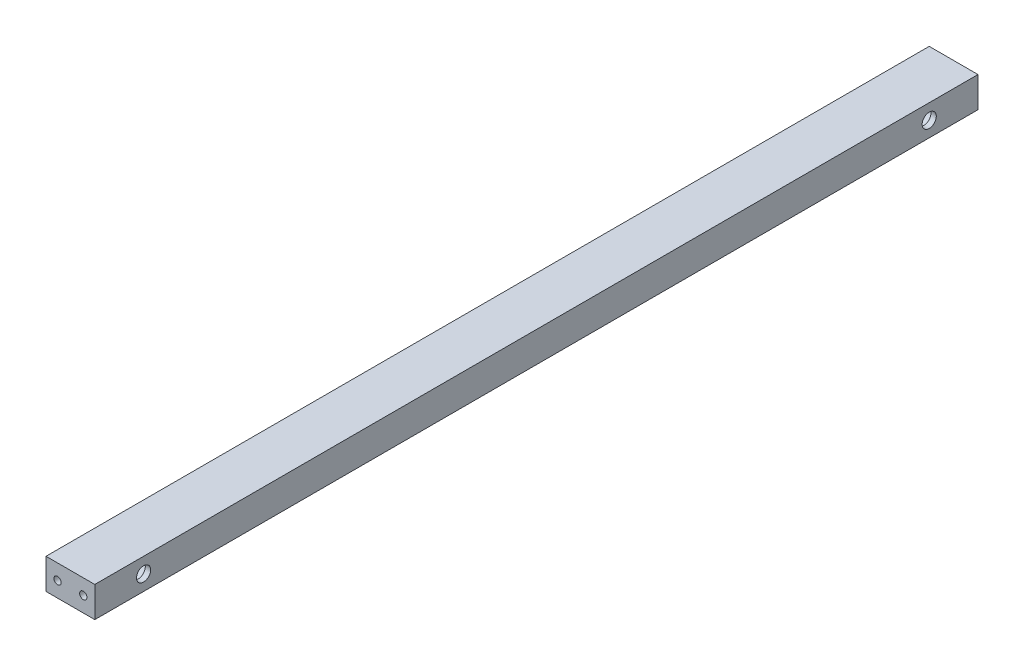
ISO-10303-21;
HEADER;
FILE_DESCRIPTION(('STEP AP214'),'2;1');
FILE_NAME('part.step','',(''),(''),'','','');
FILE_SCHEMA(('AUTOMOTIVE_DESIGN { 1 0 10303 214 1 1 1 1 }'));
ENDSEC;
DATA;
#1=APPLICATION_CONTEXT('core data for automotive mechanical design processes');
#2=APPLICATION_PROTOCOL_DEFINITION('international standard','automotive_design',2000,#1);
#3=PRODUCT_CONTEXT('',#1,'mechanical');
#4=PRODUCT('Part','Part','',(#3));
#5=PRODUCT_RELATED_PRODUCT_CATEGORY('part','',(#4));
#6=PRODUCT_DEFINITION_FORMATION('','',#4);
#7=PRODUCT_DEFINITION_CONTEXT('part definition',#1,'design');
#8=PRODUCT_DEFINITION('design','',#6,#7);
#9=PRODUCT_DEFINITION_SHAPE('','',#8);
#10=(LENGTH_UNIT() NAMED_UNIT(*) SI_UNIT(.MILLI.,.METRE.));
#11=(NAMED_UNIT(*) PLANE_ANGLE_UNIT() SI_UNIT($,.RADIAN.));
#12=(NAMED_UNIT(*) SI_UNIT($,.STERADIAN.) SOLID_ANGLE_UNIT());
#13=UNCERTAINTY_MEASURE_WITH_UNIT(LENGTH_MEASURE(1.E-05),#10,'distance_accuracy_value','');
#14=(GEOMETRIC_REPRESENTATION_CONTEXT(3) GLOBAL_UNCERTAINTY_ASSIGNED_CONTEXT((#13)) GLOBAL_UNIT_ASSIGNED_CONTEXT((#10,
#11,#12)) REPRESENTATION_CONTEXT('',''));
#15=CARTESIAN_POINT('',(0.,0.,0.));
#16=DIRECTION('',(0.,0.,1.));
#17=DIRECTION('',(1.,0.,0.));
#18=AXIS2_PLACEMENT_3D('',#15,#16,#17);
#19=CARTESIAN_POINT('',(0.,0.,459.74));
#20=DIRECTION('',(1.,0.,0.));
#21=DIRECTION('',(0.,1.,0.));
#22=AXIS2_PLACEMENT_3D('',#19,#20,#21);
#23=PLANE('',#22);
#24=CARTESIAN_POINT('',(0.,7.93749999999995,25.4));
#25=DIRECTION('',(-1.,0.,0.));
#26=DIRECTION('',(0.,1.,0.));
#27=AXIS2_PLACEMENT_3D('',#24,#25,#26);
#28=CIRCLE('',#27,6.81989999999997);
#29=CARTESIAN_POINT('',(0.,14.7573999999999,25.4));
#30=VERTEX_POINT('',#29);
#31=EDGE_CURVE('E188',#30,#30,#28,.T.);
#32=ORIENTED_EDGE('',*,*,#31,.F.);
#33=EDGE_LOOP('',(#32));
#34=FACE_BOUND('',#33,.T.);
#35=CARTESIAN_POINT('',(0.,7.9375,434.34));
#36=DIRECTION('',(-1.,0.,0.));
#37=DIRECTION('',(0.,-1.,0.));
#38=AXIS2_PLACEMENT_3D('',#35,#36,#37);
#39=CIRCLE('',#38,6.81989999999997);
#40=CARTESIAN_POINT('',(0.,1.11760000000003,434.34));
#41=VERTEX_POINT('',#40);
#42=EDGE_CURVE('E192',#41,#41,#39,.T.);
#43=ORIENTED_EDGE('',*,*,#42,.F.);
#44=EDGE_LOOP('',(#43));
#45=FACE_BOUND('',#44,.T.);
#46=DIRECTION('',(0.,-1.,0.));
#47=VECTOR('',#46,1.);
#48=CARTESIAN_POINT('',(0.,0.,0.));
#49=LINE('',#48,#47);
#50=CARTESIAN_POINT('',(0.,15.875,0.));
#51=VERTEX_POINT('',#50);
#52=CARTESIAN_POINT('',(0.,0.,0.));
#53=VERTEX_POINT('',#52);
#54=EDGE_CURVE('E107',#51,#53,#49,.T.);
#55=ORIENTED_EDGE('',*,*,#54,.T.);
#56=DIRECTION('',(0.,0.,-1.));
#57=VECTOR('',#56,1.);
#58=CARTESIAN_POINT('',(0.,0.,459.74));
#59=LINE('',#58,#57);
#60=CARTESIAN_POINT('',(0.,0.,459.74));
#61=VERTEX_POINT('',#60);
#62=EDGE_CURVE('E11',#61,#53,#59,.T.);
#63=ORIENTED_EDGE('',*,*,#62,.F.);
#64=DIRECTION('',(0.,-1.,0.));
#65=VECTOR('',#64,1.);
#66=CARTESIAN_POINT('',(0.,0.,459.74));
#67=LINE('',#66,#65);
#68=CARTESIAN_POINT('',(0.,15.875,459.74));
#69=VERTEX_POINT('',#68);
#70=EDGE_CURVE('E94',#69,#61,#67,.T.);
#71=ORIENTED_EDGE('',*,*,#70,.F.);
#72=DIRECTION('',(0.,0.,-1.));
#73=VECTOR('',#72,1.);
#74=CARTESIAN_POINT('',(0.,15.875,459.74));
#75=LINE('',#74,#73);
#76=EDGE_CURVE('E103',#69,#51,#75,.T.);
#77=ORIENTED_EDGE('',*,*,#76,.T.);
#78=EDGE_LOOP('',(#55,#63,#71,#77));
#79=FACE_BOUND('',#78,.T.);
#80=ADVANCED_FACE('F37',(#34,#45,#79),#23,.F.);
#81=CARTESIAN_POINT('',(0.,0.,459.74));
#82=DIRECTION('',(0.,1.,0.));
#83=DIRECTION('',(0.,0.,1.));
#84=AXIS2_PLACEMENT_3D('',#81,#82,#83);
#85=PLANE('',#84);
#86=DIRECTION('',(1.,0.,0.));
#87=VECTOR('',#86,1.);
#88=CARTESIAN_POINT('',(0.,0.,0.));
#89=LINE('',#88,#87);
#90=CARTESIAN_POINT('',(25.4,0.,0.));
#91=VERTEX_POINT('',#90);
#92=EDGE_CURVE('E98',#53,#91,#89,.T.);
#93=ORIENTED_EDGE('',*,*,#92,.T.);
#94=DIRECTION('',(0.,0.,-1.));
#95=VECTOR('',#94,1.);
#96=CARTESIAN_POINT('',(25.4,0.,459.74));
#97=LINE('',#96,#95);
#98=CARTESIAN_POINT('',(25.4,0.,459.74));
#99=VERTEX_POINT('',#98);
#100=EDGE_CURVE('E50',#99,#91,#97,.T.);
#101=ORIENTED_EDGE('',*,*,#100,.F.);
#102=DIRECTION('',(1.,0.,0.));
#103=VECTOR('',#102,1.);
#104=CARTESIAN_POINT('',(0.,0.,459.74));
#105=LINE('',#104,#103);
#106=EDGE_CURVE('E89',#61,#99,#105,.T.);
#107=ORIENTED_EDGE('',*,*,#106,.F.);
#108=ORIENTED_EDGE('',*,*,#62,.T.);
#109=EDGE_LOOP('',(#93,#101,#107,#108));
#110=FACE_BOUND('',#109,.T.);
#111=ADVANCED_FACE('F97',(#110),#85,.F.);
#112=CARTESIAN_POINT('',(25.4,0.,459.74));
#113=DIRECTION('',(-1.,0.,0.));
#114=DIRECTION('',(0.,-1.,0.));
#115=AXIS2_PLACEMENT_3D('',#112,#113,#114);
#116=PLANE('',#115);
#117=CARTESIAN_POINT('',(25.4,7.93749999999995,25.4));
#118=DIRECTION('',(-1.,0.,0.));
#119=DIRECTION('',(0.,-1.,0.));
#120=AXIS2_PLACEMENT_3D('',#117,#118,#119);
#121=CIRCLE('',#120,3.68299999999999);
#122=CARTESIAN_POINT('',(25.4,4.25449999999996,25.4));
#123=VERTEX_POINT('',#122);
#124=EDGE_CURVE('E116',#123,#123,#121,.T.);
#125=ORIENTED_EDGE('',*,*,#124,.T.);
#126=EDGE_LOOP('',(#125));
#127=FACE_BOUND('',#126,.T.);
#128=CARTESIAN_POINT('',(25.4,7.9375,434.34));
#129=DIRECTION('',(-1.,0.,0.));
#130=DIRECTION('',(0.,-1.,0.));
#131=AXIS2_PLACEMENT_3D('',#128,#129,#130);
#132=CIRCLE('',#131,3.68299999999999);
#133=CARTESIAN_POINT('',(25.4,4.25450000000001,434.34));
#134=VERTEX_POINT('',#133);
#135=EDGE_CURVE('E219',#134,#134,#132,.T.);
#136=ORIENTED_EDGE('',*,*,#135,.T.);
#137=EDGE_LOOP('',(#136));
#138=FACE_BOUND('',#137,.T.);
#139=DIRECTION('',(0.,1.,0.));
#140=VECTOR('',#139,1.);
#141=CARTESIAN_POINT('',(25.4,0.,0.));
#142=LINE('',#141,#140);
#143=CARTESIAN_POINT('',(25.4,15.875,0.));
#144=VERTEX_POINT('',#143);
#145=EDGE_CURVE('E76',#91,#144,#142,.T.);
#146=ORIENTED_EDGE('',*,*,#145,.T.);
#147=DIRECTION('',(0.,0.,-1.));
#148=VECTOR('',#147,1.);
#149=CARTESIAN_POINT('',(25.4,15.875,459.74));
#150=LINE('',#149,#148);
#151=CARTESIAN_POINT('',(25.4,15.875,459.74));
#152=VERTEX_POINT('',#151);
#153=EDGE_CURVE('E99',#152,#144,#150,.T.);
#154=ORIENTED_EDGE('',*,*,#153,.F.);
#155=DIRECTION('',(0.,1.,0.));
#156=VECTOR('',#155,1.);
#157=CARTESIAN_POINT('',(25.4,0.,459.74));
#158=LINE('',#157,#156);
#159=EDGE_CURVE('E92',#99,#152,#158,.T.);
#160=ORIENTED_EDGE('',*,*,#159,.F.);
#161=ORIENTED_EDGE('',*,*,#100,.T.);
#162=EDGE_LOOP('',(#146,#154,#160,#161));
#163=FACE_BOUND('',#162,.T.);
#164=ADVANCED_FACE('F101',(#127,#138,#163),#116,.F.);
#165=CARTESIAN_POINT('',(0.,15.875,459.74));
#166=DIRECTION('',(0.,-1.,0.));
#167=DIRECTION('',(0.,0.,-1.));
#168=AXIS2_PLACEMENT_3D('',#165,#166,#167);
#169=PLANE('',#168);
#170=DIRECTION('',(-1.,0.,0.));
#171=VECTOR('',#170,1.);
#172=CARTESIAN_POINT('',(0.,15.875,0.));
#173=LINE('',#172,#171);
#174=EDGE_CURVE('E82',#144,#51,#173,.T.);
#175=ORIENTED_EDGE('',*,*,#174,.T.);
#176=ORIENTED_EDGE('',*,*,#76,.F.);
#177=DIRECTION('',(-1.,0.,0.));
#178=VECTOR('',#177,1.);
#179=CARTESIAN_POINT('',(0.,15.875,459.74));
#180=LINE('',#179,#178);
#181=EDGE_CURVE('E59',#152,#69,#180,.T.);
#182=ORIENTED_EDGE('',*,*,#181,.F.);
#183=ORIENTED_EDGE('',*,*,#153,.T.);
#184=EDGE_LOOP('',(#175,#176,#182,#183));
#185=FACE_BOUND('',#184,.T.);
#186=ADVANCED_FACE('F204',(#185),#169,.F.);
#187=CARTESIAN_POINT('',(0.,0.,459.74));
#188=DIRECTION('',(0.,0.,-1.));
#189=DIRECTION('',(-1.,0.,0.));
#190=AXIS2_PLACEMENT_3D('',#187,#188,#189);
#191=PLANE('',#190);
#192=CARTESIAN_POINT('',(19.4000000000001,7.93749999999993,459.74));
#193=DIRECTION('',(0.,0.,1.));
#194=DIRECTION('',(1.,0.,0.));
#195=AXIS2_PLACEMENT_3D('',#192,#193,#194);
#196=CIRCLE('',#195,1.89864999999999);
#197=CARTESIAN_POINT('',(21.2986500000001,7.93749999999993,459.74));
#198=VERTEX_POINT('',#197);
#199=EDGE_CURVE('E166',#198,#198,#196,.T.);
#200=ORIENTED_EDGE('',*,*,#199,.F.);
#201=EDGE_LOOP('',(#200));
#202=FACE_BOUND('',#201,.T.);
#203=CARTESIAN_POINT('',(5.99999999999978,7.93749999999993,459.74));
#204=DIRECTION('',(0.,0.,1.));
#205=DIRECTION('',(1.,0.,0.));
#206=AXIS2_PLACEMENT_3D('',#203,#204,#205);
#207=CIRCLE('',#206,1.89865);
#208=CARTESIAN_POINT('',(7.89864999999978,7.93749999999993,459.74));
#209=VERTEX_POINT('',#208);
#210=EDGE_CURVE('E128',#209,#209,#207,.T.);
#211=ORIENTED_EDGE('',*,*,#210,.F.);
#212=EDGE_LOOP('',(#211));
#213=FACE_BOUND('',#212,.T.);
#214=ORIENTED_EDGE('',*,*,#70,.T.);
#215=ORIENTED_EDGE('',*,*,#106,.T.);
#216=ORIENTED_EDGE('',*,*,#159,.T.);
#217=ORIENTED_EDGE('',*,*,#181,.T.);
#218=EDGE_LOOP('',(#214,#215,#216,#217));
#219=FACE_BOUND('',#218,.T.);
#220=ADVANCED_FACE('F90',(#202,#213,#219),#191,.F.);
#221=CARTESIAN_POINT('',(0.,0.,0.));
#222=DIRECTION('',(0.,0.,-1.));
#223=DIRECTION('',(-1.,0.,0.));
#224=AXIS2_PLACEMENT_3D('',#221,#222,#223);
#225=PLANE('',#224);
#226=CARTESIAN_POINT('',(19.4,7.9375,0.));
#227=DIRECTION('',(0.,0.,-1.));
#228=DIRECTION('',(-1.,0.,0.));
#229=AXIS2_PLACEMENT_3D('',#226,#227,#228);
#230=CIRCLE('',#229,1.89864999999999);
#231=CARTESIAN_POINT('',(17.50135,7.9375,0.));
#232=VERTEX_POINT('',#231);
#233=EDGE_CURVE('E347',#232,#232,#230,.T.);
#234=ORIENTED_EDGE('',*,*,#233,.F.);
#235=EDGE_LOOP('',(#234));
#236=FACE_BOUND('',#235,.T.);
#237=CARTESIAN_POINT('',(6.,7.9375,0.));
#238=DIRECTION('',(0.,0.,-1.));
#239=DIRECTION('',(-1.,0.,0.));
#240=AXIS2_PLACEMENT_3D('',#237,#238,#239);
#241=CIRCLE('',#240,1.89865);
#242=CARTESIAN_POINT('',(4.10135,7.9375,0.));
#243=VERTEX_POINT('',#242);
#244=EDGE_CURVE('E167',#243,#243,#241,.T.);
#245=ORIENTED_EDGE('',*,*,#244,.F.);
#246=EDGE_LOOP('',(#245));
#247=FACE_BOUND('',#246,.T.);
#248=ORIENTED_EDGE('',*,*,#54,.F.);
#249=ORIENTED_EDGE('',*,*,#174,.F.);
#250=ORIENTED_EDGE('',*,*,#145,.F.);
#251=ORIENTED_EDGE('',*,*,#92,.F.);
#252=EDGE_LOOP('',(#248,#249,#250,#251));
#253=FACE_BOUND('',#252,.T.);
#254=ADVANCED_FACE('F195',(#236,#247,#253),#225,.T.);
#255=CARTESIAN_POINT('',(22.61362,7.9375,434.34));
#256=DIRECTION('',(-1.,0.,0.));
#257=DIRECTION('',(0.,-1.,0.));
#258=AXIS2_PLACEMENT_3D('',#255,#256,#257);
#259=CYLINDRICAL_SURFACE('',#258,6.81989999999997);
#260=CARTESIAN_POINT('',(21.2986500000001,7.93749999999993,441.1599));
#261=CARTESIAN_POINT('',(21.2986478955113,8.04199426821692,441.159898614224));
#262=CARTESIAN_POINT('',(21.2899947398905,8.1465104934207,441.157475004124));
#263=CARTESIAN_POINT('',(21.2556790489972,8.35252088754178,441.148042559999));
#264=CARTESIAN_POINT('',(21.2300093952255,8.45401377313264,441.141031807054));
#265=CARTESIAN_POINT('',(21.1625683981147,8.65097488763713,441.123196987147));
#266=CARTESIAN_POINT('',(21.1208188479997,8.74645106812393,441.112378083106));
#267=CARTESIAN_POINT('',(21.0224869248622,8.92904714071109,441.088063856518));
#268=CARTESIAN_POINT('',(20.9659032165388,9.01616627958527,441.074568293058));
#269=CARTESIAN_POINT('',(20.8380117298547,9.18176026115542,441.045973370361));
#270=CARTESIAN_POINT('',(20.7664005272015,9.25999569958802,441.030844694203));
#271=CARTESIAN_POINT('',(20.6111347622745,9.40351629108421,441.000872233691));
#272=CARTESIAN_POINT('',(20.5274785001873,9.46879961323204,440.986028489881));
#273=CARTESIAN_POINT('',(20.3485476011592,9.58576117360392,440.958003286193));
#274=CARTESIAN_POINT('',(20.253082928137,9.63715832516758,440.944858633072));
#275=CARTESIAN_POINT('',(20.0544414315767,9.72307589900526,440.922153403627));
#276=CARTESIAN_POINT('',(19.9512661782996,9.75759974679073,440.912592099925));
#277=CARTESIAN_POINT('',(19.7427968043785,9.80794841719242,440.898439785376));
#278=CARTESIAN_POINT('',(19.6376161933298,9.82420985156586,440.893732951012));
#279=CARTESIAN_POINT('',(19.4259225758519,9.83893410149413,440.889476939271));
#280=CARTESIAN_POINT('',(19.3194098473418,9.83740056971003,440.889926703431));
#281=CARTESIAN_POINT('',(19.1115305635186,9.8169237815468,440.89582974716));
#282=CARTESIAN_POINT('',(19.0101062940827,9.79851501095365,440.901129408259));
#283=CARTESIAN_POINT('',(18.8118462807709,9.74566889349141,440.915888272233));
#284=CARTESIAN_POINT('',(18.7150109336987,9.71123016328961,440.925347834089));
#285=CARTESIAN_POINT('',(18.5273137081939,9.62688062894725,440.947491424629));
#286=CARTESIAN_POINT('',(18.4365385089531,9.57678726330559,440.960213164514));
#287=CARTESIAN_POINT('',(18.2644975897965,9.46267759402096,440.987428155841));
#288=CARTESIAN_POINT('',(18.1832338976187,9.39865832983041,441.001921783687));
#289=CARTESIAN_POINT('',(18.0294762770702,9.2558078090029,441.031681390883));
#290=CARTESIAN_POINT('',(17.9573988712531,9.17652944595725,441.0469564735));
#291=CARTESIAN_POINT('',(17.8274726522489,9.00682225173164,441.076095876323));
#292=CARTESIAN_POINT('',(17.7696245042105,8.91639289959357,441.089960130563));
#293=CARTESIAN_POINT('',(17.6695923941825,8.72626784080234,441.114814161756));
#294=CARTESIAN_POINT('',(17.627489559752,8.62652736357818,441.125788967327));
#295=CARTESIAN_POINT('',(17.5607726685057,8.42100731024903,441.143519568753));
#296=CARTESIAN_POINT('',(17.5361544342171,8.31522918320682,441.150276372339));
#297=CARTESIAN_POINT('',(17.5057728843015,8.10418644687428,441.158654869806));
#298=CARTESIAN_POINT('',(17.499443909497,7.99900925970304,441.160430569208));
#299=CARTESIAN_POINT('',(17.5042504801261,7.78909423175633,441.159092627649));
#300=CARTESIAN_POINT('',(17.5153840446958,7.68435634250036,441.155979541248));
#301=CARTESIAN_POINT('',(17.55433768952,7.48035136105017,441.145313800666));
#302=CARTESIAN_POINT('',(17.5818371592724,7.38101817359114,441.137846501549));
#303=CARTESIAN_POINT('',(17.6523651557075,7.18838841332296,441.119324407117));
#304=CARTESIAN_POINT('',(17.6953954372603,7.09509252409054,441.108269206408));
#305=CARTESIAN_POINT('',(17.7967785327229,6.91502709432654,441.083443085299));
#306=CARTESIAN_POINT('',(17.8554323247568,6.82843434737765,441.069620313163));
#307=CARTESIAN_POINT('',(17.9860235551887,6.66612368071269,441.040853992112));
#308=CARTESIAN_POINT('',(18.0579638604642,6.59040811428458,441.025910201725));
#309=CARTESIAN_POINT('',(18.2157334561316,6.44958002592191,440.996010843381));
#310=CARTESIAN_POINT('',(18.3019235663301,6.38486798170596,440.981069212785));
#311=CARTESIAN_POINT('',(18.4842599303104,6.27081060206779,440.95336829555));
#312=CARTESIAN_POINT('',(18.580405805507,6.22146468260789,440.940608925976));
#313=CARTESIAN_POINT('',(18.7794892790294,6.13990677605602,440.918865966359));
#314=CARTESIAN_POINT('',(18.882385640395,6.10759999003559,440.909861545238));
#315=CARTESIAN_POINT('',(19.0924476071347,6.06083999768371,440.89665958219));
#316=CARTESIAN_POINT('',(19.1996119907933,6.04638171962304,440.892460674782));
#317=CARTESIAN_POINT('',(19.4110482750274,6.03603968444624,440.889466355259));
#318=CARTESIAN_POINT('',(19.5152863364827,6.03950932892519,440.890482832698));
#319=CARTESIAN_POINT('',(19.7216282846674,6.06340995827339,440.89736028445));
#320=CARTESIAN_POINT('',(19.8237322359124,6.08384042964326,440.903221112098));
#321=CARTESIAN_POINT('',(20.022011577989,6.14069275146014,440.919009912945));
#322=CARTESIAN_POINT('',(20.1182328135229,6.17696597812313,440.928900030028));
#323=CARTESIAN_POINT('',(20.3032987215904,6.26435920149553,440.951631068142));
#324=CARTESIAN_POINT('',(20.3921421415707,6.31548171261182,440.964472488836));
#325=CARTESIAN_POINT('',(20.5629880762326,6.43303278738152,440.992169985688));
#326=CARTESIAN_POINT('',(20.6446825872612,6.49989698517997,441.007077201619));
#327=CARTESIAN_POINT('',(20.7959016417658,6.6462200527362,441.036954443601));
#328=CARTESIAN_POINT('',(20.8654231597193,6.72568204427359,441.051924484323));
#329=CARTESIAN_POINT('',(20.9919679081722,6.89724037603984,441.080669851186));
#330=CARTESIAN_POINT('',(21.048651923864,6.98959373105538,441.094407976686));
#331=CARTESIAN_POINT('',(21.1456023209155,7.18290063704632,441.118722431774));
#332=CARTESIAN_POINT('',(21.1858782945093,7.28384912140474,441.129300607718));
#333=CARTESIAN_POINT('',(21.2441647202228,7.47646864434039,441.144883738395));
#334=CARTESIAN_POINT('',(21.2645466675971,7.56738158245504,441.150471988071));
#335=CARTESIAN_POINT('',(21.2917894391004,7.75135737804588,441.15798051751));
#336=CARTESIAN_POINT('',(21.2986518746087,7.84441997796778,441.159901234403));
#337=CARTESIAN_POINT('',(21.2986500000001,7.93749999999993,441.1599));
#338=B_SPLINE_CURVE_WITH_KNOTS('',3,(#260,#261,#262,#263,#264,#265,#266,#267,#268,#269,#270,
#271,#272,#273,#274,#275,#276,#277,#278,#279,#280,#281,#282,#283,#284,#285,#286,#287,#288,#289,
#290,#291,#292,#293,#294,#295,#296,#297,#298,#299,#300,#301,#302,#303,#304,#305,#306,#307,#308,
#309,#310,#311,#312,#313,#314,#315,#316,#317,#318,#319,#320,#321,#322,#323,#324,#325,#326,#327,
#328,#329,#330,#331,#332,#333,#334,#335,#336,#337),.UNSPECIFIED.,.T.,.F.,(4,2,2,2,2,2,2,2,2,2,2,
2,2,2,2,2,2,2,2,2,2,2,2,2,2,2,2,2,2,2,2,2,2,2,2,2,2,2,4),(0.,0.313141270174925,
0.626413619242761,0.939262873183989,1.25214029801242,1.57207746518011,1.89205982660547,
2.21810240921309,2.54407877319405,2.86208388379862,3.18002372064378,3.48822892623018,
3.79646073384292,4.1084303919815,4.42046643759517,4.74363943375518,5.06682753381501,
5.39165863533402,5.71641210110527,6.03100793965357,6.34556809458989,6.65415992618043,
6.96278663735156,7.27785299642317,7.59298741806278,7.91787082588563,8.24274188398955,
8.56578589717568,8.8887380948908,9.20012564193415,9.51150376187353,9.82002150533519,
10.128591520124,10.4469893925022,10.7654662887254,11.0915707691149,11.4174843324611,
11.6964534231008,11.9753892616343),.UNSPECIFIED.);
#339=CARTESIAN_POINT('',(21.2986500000001,7.93749999999993,441.1599));
#340=VERTEX_POINT('',#339);
#341=EDGE_CURVE('E129',#340,#340,#338,.T.);
#342=ORIENTED_EDGE('',*,*,#341,.T.);
#343=EDGE_LOOP('',(#342));
#344=FACE_BOUND('',#343,.T.);
#345=CARTESIAN_POINT('',(7.89864999999978,7.93749999999993,441.1599));
#346=CARTESIAN_POINT('',(7.89864789551102,8.04199426821692,441.159898614224));
#347=CARTESIAN_POINT('',(7.88999473989024,8.1465104934207,441.157475004124));
#348=CARTESIAN_POINT('',(7.85567904899688,8.35252088754178,441.148042559999));
#349=CARTESIAN_POINT('',(7.83000939522516,8.45401377313265,441.141031807054));
#350=CARTESIAN_POINT('',(7.76256839811438,8.65097488763713,441.123196987147));
#351=CARTESIAN_POINT('',(7.72081884799938,8.74645106812393,441.112378083106));
#352=CARTESIAN_POINT('',(7.62248692486186,8.92904714071109,441.088063856518));
#353=CARTESIAN_POINT('',(7.56590321653849,9.01616627958527,441.074568293058));
#354=CARTESIAN_POINT('',(7.43801172985437,9.18176026115542,441.045973370361));
#355=CARTESIAN_POINT('',(7.36640052720116,9.25999569958803,441.030844694203));
#356=CARTESIAN_POINT('',(7.21113476227422,9.40351629108422,441.000872233691));
#357=CARTESIAN_POINT('',(7.12747850018697,9.46879961323205,440.986028489881));
#358=CARTESIAN_POINT('',(6.94854760115893,9.58576117360393,440.958003286193));
#359=CARTESIAN_POINT('',(6.85308292813666,9.63715832516759,440.944858633072));
#360=CARTESIAN_POINT('',(6.65444143157643,9.72307589900526,440.922153403626));
#361=CARTESIAN_POINT('',(6.55126617829933,9.75759974679073,440.912592099925));
#362=CARTESIAN_POINT('',(6.34279680437821,9.80794841719242,440.898439785376));
#363=CARTESIAN_POINT('',(6.23761619332951,9.82420985156586,440.893732951012));
#364=CARTESIAN_POINT('',(6.02592257585164,9.83893410149413,440.889476939271));
#365=CARTESIAN_POINT('',(5.91940984734151,9.83740056971003,440.889926703431));
#366=CARTESIAN_POINT('',(5.71153056351829,9.8169237815468,440.89582974716));
#367=CARTESIAN_POINT('',(5.61010629408235,9.79851501095365,440.901129408259));
#368=CARTESIAN_POINT('',(5.41184628077059,9.74566889349141,440.915888272233));
#369=CARTESIAN_POINT('',(5.31501093369845,9.71123016328961,440.925347834089));
#370=CARTESIAN_POINT('',(5.1273137081936,9.62688062894725,440.947491424629));
#371=CARTESIAN_POINT('',(5.03653850895277,9.57678726330559,440.960213164514));
#372=CARTESIAN_POINT('',(4.86449758979617,9.46267759402096,440.987428155841));
#373=CARTESIAN_POINT('',(4.7832338976184,9.39865832983041,441.001921783687));
#374=CARTESIAN_POINT('',(4.62947627706991,9.2558078090029,441.031681390883));
#375=CARTESIAN_POINT('',(4.55739887125282,9.17652944595725,441.0469564735));
#376=CARTESIAN_POINT('',(4.42747265224861,9.00682225173164,441.076095876323));
#377=CARTESIAN_POINT('',(4.36962450421023,8.91639289959357,441.089960130563));
#378=CARTESIAN_POINT('',(4.26959239418219,8.72626784080234,441.114814161756));
#379=CARTESIAN_POINT('',(4.22748955975166,8.62652736357819,441.125788967327));
#380=CARTESIAN_POINT('',(4.16077266850536,8.42100731024903,441.143519568753));
#381=CARTESIAN_POINT('',(4.13615443421676,8.31522918320682,441.150276372339));
#382=CARTESIAN_POINT('',(4.10577288430121,8.10418644687428,441.158654869806));
#383=CARTESIAN_POINT('',(4.09944390949671,7.99900925970304,441.160430569208));
#384=CARTESIAN_POINT('',(4.10425048012579,7.78909423175632,441.159092627649));
#385=CARTESIAN_POINT('',(4.11538404469545,7.68435634250035,441.155979541248));
#386=CARTESIAN_POINT('',(4.15433768951966,7.48035136105017,441.145313800666));
#387=CARTESIAN_POINT('',(4.1818371592721,7.38101817359114,441.137846501549));
#388=CARTESIAN_POINT('',(4.25236515570724,7.18838841332296,441.119324407117));
#389=CARTESIAN_POINT('',(4.29539543726004,7.09509252409053,441.108269206408));
#390=CARTESIAN_POINT('',(4.39677853272256,6.91502709432654,441.083443085299));
#391=CARTESIAN_POINT('',(4.4554323247565,6.82843434737765,441.069620313163));
#392=CARTESIAN_POINT('',(4.5860235551884,6.66612368071269,441.040853992112));
#393=CARTESIAN_POINT('',(4.65796386046394,6.59040811428458,441.025910201725));
#394=CARTESIAN_POINT('',(4.81573345613125,6.44958002592191,440.996010843381));
#395=CARTESIAN_POINT('',(4.90192356632977,6.38486798170596,440.981069212785));
#396=CARTESIAN_POINT('',(5.0842599303101,6.27081060206779,440.95336829555));
#397=CARTESIAN_POINT('',(5.18040580550674,6.22146468260788,440.940608925976));
#398=CARTESIAN_POINT('',(5.37948927902906,6.13990677605602,440.918865966359));
#399=CARTESIAN_POINT('',(5.48238564039475,6.10759999003559,440.909861545238));
#400=CARTESIAN_POINT('',(5.69244760713438,6.06083999768371,440.89665958219));
#401=CARTESIAN_POINT('',(5.79961199079304,6.04638171962304,440.892460674782));
#402=CARTESIAN_POINT('',(6.01104827502711,6.03603968444624,440.889466355259));
#403=CARTESIAN_POINT('',(6.11528633648243,6.03950932892519,440.890482832698));
#404=CARTESIAN_POINT('',(6.32162828466713,6.06340995827339,440.89736028445));
#405=CARTESIAN_POINT('',(6.42373223591207,6.08384042964326,440.903221112098));
#406=CARTESIAN_POINT('',(6.6220115779887,6.14069275146014,440.919009912945));
#407=CARTESIAN_POINT('',(6.71823281352263,6.17696597812313,440.928900030028));
#408=CARTESIAN_POINT('',(6.9032987215901,6.26435920149553,440.951631068142));
#409=CARTESIAN_POINT('',(6.99214214157043,6.31548171261182,440.964472488836));
#410=CARTESIAN_POINT('',(7.16298807623234,6.43303278738152,440.992169985688));
#411=CARTESIAN_POINT('',(7.24468258726089,6.49989698517997,441.007077201619));
#412=CARTESIAN_POINT('',(7.39590164176546,6.6462200527362,441.036954443601));
#413=CARTESIAN_POINT('',(7.46542315971903,6.72568204427359,441.051924484323));
#414=CARTESIAN_POINT('',(7.59196790817187,6.89724037603984,441.080669851186));
#415=CARTESIAN_POINT('',(7.64865192386375,6.98959373105538,441.094407976686));
#416=CARTESIAN_POINT('',(7.74560232091524,7.18290063704632,441.118722431774));
#417=CARTESIAN_POINT('',(7.78587829450898,7.28384912140474,441.129300607718));
#418=CARTESIAN_POINT('',(7.8441647202225,7.47646864434039,441.144883738395));
#419=CARTESIAN_POINT('',(7.86454666759681,7.56738158245505,441.150471988071));
#420=CARTESIAN_POINT('',(7.89178943910009,7.75135737804588,441.15798051751));
#421=CARTESIAN_POINT('',(7.89865187460843,7.84441997796778,441.159901234403));
#422=CARTESIAN_POINT('',(7.89864999999978,7.93749999999993,441.1599));
#423=B_SPLINE_CURVE_WITH_KNOTS('',3,(#345,#346,#347,#348,#349,#350,#351,#352,#353,#354,#355,
#356,#357,#358,#359,#360,#361,#362,#363,#364,#365,#366,#367,#368,#369,#370,#371,#372,#373,#374,
#375,#376,#377,#378,#379,#380,#381,#382,#383,#384,#385,#386,#387,#388,#389,#390,#391,#392,#393,
#394,#395,#396,#397,#398,#399,#400,#401,#402,#403,#404,#405,#406,#407,#408,#409,#410,#411,#412,
#413,#414,#415,#416,#417,#418,#419,#420,#421,#422),.UNSPECIFIED.,.T.,.F.,(4,2,2,2,2,2,2,2,2,2,2,
2,2,2,2,2,2,2,2,2,2,2,2,2,2,2,2,2,2,2,2,2,2,2,2,2,2,2,4),(0.,0.313141270174925,
0.626413619242763,0.939262873183991,1.25214029801242,1.57207746518013,1.89205982660548,
2.2181024092131,2.54407877319406,2.86208388379862,3.18002372064379,3.48822892623018,
3.79646073384292,4.10843039198151,4.42046643759518,4.74363943375518,5.06682753381502,
5.39165863533402,5.71641210110528,6.03100793965357,6.3455680945899,6.65415992618043,
6.96278663735156,7.27785299642318,7.59298741806278,7.91787082588563,8.24274188398955,
8.56578589717569,8.88873809489081,9.20012564193416,9.51150376187353,9.82002150533519,
10.128591520124,10.4469893925022,10.7654662887254,11.0915707691149,11.4174843324611,
11.6964534231008,11.9753892616343),.UNSPECIFIED.);
#424=CARTESIAN_POINT('',(7.89864999999978,7.93749999999993,441.1599));
#425=VERTEX_POINT('',#424);
#426=EDGE_CURVE('E121',#425,#425,#423,.T.);
#427=ORIENTED_EDGE('',*,*,#426,.T.);
#428=EDGE_LOOP('',(#427));
#429=FACE_BOUND('',#428,.T.);
#430=CARTESIAN_POINT('',(22.61362,7.9375,434.34));
#431=DIRECTION('',(-1.,0.,0.));
#432=DIRECTION('',(0.,-1.,0.));
#433=AXIS2_PLACEMENT_3D('',#430,#431,#432);
#434=CIRCLE('',#433,6.81989999999997);
#435=CARTESIAN_POINT('',(22.61362,1.11760000000003,434.34));
#436=VERTEX_POINT('',#435);
#437=EDGE_CURVE('E110',#436,#436,#434,.T.);
#438=ORIENTED_EDGE('',*,*,#437,.F.);
#439=EDGE_LOOP('',(#438));
#440=FACE_BOUND('',#439,.T.);
#441=ORIENTED_EDGE('',*,*,#42,.T.);
#442=EDGE_LOOP('',(#441));
#443=FACE_BOUND('',#442,.T.);
#444=ADVANCED_FACE('F133',(#344,#429,#440,#443),#259,.F.);
#445=CARTESIAN_POINT('',(22.61362,7.9375,434.34));
#446=DIRECTION('',(-1.,0.,0.));
#447=DIRECTION('',(0.,-1.,0.));
#448=AXIS2_PLACEMENT_3D('',#445,#446,#447);
#449=PLANE('',#448);
#450=CARTESIAN_POINT('',(22.61362,7.9375,434.34));
#451=DIRECTION('',(-1.,0.,0.));
#452=DIRECTION('',(0.,0.,1.));
#453=AXIS2_PLACEMENT_3D('',#450,#451,#452);
#454=CIRCLE('',#453,3.68299999999999);
#455=CARTESIAN_POINT('',(22.61362,7.9375,438.023));
#456=VERTEX_POINT('',#455);
#457=EDGE_CURVE('E119',#456,#456,#454,.T.);
#458=ORIENTED_EDGE('',*,*,#457,.F.);
#459=EDGE_LOOP('',(#458));
#460=FACE_BOUND('',#459,.T.);
#461=ORIENTED_EDGE('',*,*,#437,.T.);
#462=EDGE_LOOP('',(#461));
#463=FACE_BOUND('',#462,.T.);
#464=ADVANCED_FACE('F159',(#460,#463),#449,.T.);
#465=CARTESIAN_POINT('',(22.61362,7.93749999999995,25.4));
#466=DIRECTION('',(-1.,0.,0.));
#467=DIRECTION('',(0.,-1.,0.));
#468=AXIS2_PLACEMENT_3D('',#465,#466,#467);
#469=CYLINDRICAL_SURFACE('',#468,6.81989999999997);
#470=CARTESIAN_POINT('',(17.50135,7.9375,18.5801));
#471=CARTESIAN_POINT('',(17.5013521044888,8.04199426821699,18.5801013857759));
#472=CARTESIAN_POINT('',(17.5100052601095,8.14651049342077,18.5825249958761));
#473=CARTESIAN_POINT('',(17.5443209510029,8.35252088754185,18.591957440001));
#474=CARTESIAN_POINT('',(17.5699906047746,8.45401377313271,18.5989681929459));
#475=CARTESIAN_POINT('',(17.6374316018854,8.6509748876372,18.6168030128534));
#476=CARTESIAN_POINT('',(17.6791811520004,8.746451068124,18.6276219168943));
#477=CARTESIAN_POINT('',(17.7775130751379,8.92904714071116,18.6519361434817));
#478=CARTESIAN_POINT('',(17.8340967834613,9.01616627958534,18.6654317069418));
#479=CARTESIAN_POINT('',(17.9619882701454,9.18176026115549,18.6940266296391));
#480=CARTESIAN_POINT('',(18.0335994727986,9.2599956995881,18.7091553057967));
#481=CARTESIAN_POINT('',(18.1888652377256,9.40351629108429,18.7391277663095));
#482=CARTESIAN_POINT('',(18.2725214998128,9.46879961323211,18.7539715101192));
#483=CARTESIAN_POINT('',(18.4514523988409,9.58576117360399,18.7819967138073));
#484=CARTESIAN_POINT('',(18.5469170718631,9.63715832516766,18.7951413669284));
#485=CARTESIAN_POINT('',(18.7455585684234,9.72307589900533,18.8178465963736));
#486=CARTESIAN_POINT('',(18.8487338217005,9.7575997467908,18.8274079000747));
#487=CARTESIAN_POINT('',(19.0572031956216,9.80794841719249,18.8415602146244));
#488=CARTESIAN_POINT('',(19.1623838066703,9.82420985156593,18.8462670489883));
#489=CARTESIAN_POINT('',(19.3740774241481,9.8389341014942,18.850523060729));
#490=CARTESIAN_POINT('',(19.4805901526583,9.8374005697101,18.8500732965686));
#491=CARTESIAN_POINT('',(19.6884694364815,9.81692378154687,18.8441702528398));
#492=CARTESIAN_POINT('',(19.7898937059174,9.79851501095372,18.8388705917412));
#493=CARTESIAN_POINT('',(19.9881537192292,9.74566889349148,18.8241117277675));
#494=CARTESIAN_POINT('',(20.0849890663013,9.71123016328968,18.8146521659106));
#495=CARTESIAN_POINT('',(20.2726862918062,9.62688062894732,18.7925085753714));
#496=CARTESIAN_POINT('',(20.363461491047,9.57678726330566,18.7797868354865));
#497=CARTESIAN_POINT('',(20.5355024102036,9.46267759402103,18.752571844159));
#498=CARTESIAN_POINT('',(20.6167661023814,9.39865832983049,18.738078216313));
#499=CARTESIAN_POINT('',(20.7705237229299,9.25580780900297,18.7083186091165));
#500=CARTESIAN_POINT('',(20.842601128747,9.17652944595732,18.6930435265004));
#501=CARTESIAN_POINT('',(20.9725273477512,9.00682225173171,18.6639041236772));
#502=CARTESIAN_POINT('',(21.0303754957895,8.91639289959364,18.6500398694371));
#503=CARTESIAN_POINT('',(21.1304076058176,8.72626784080241,18.6251858382437));
#504=CARTESIAN_POINT('',(21.1725104402481,8.62652736357825,18.6142110326728));
#505=CARTESIAN_POINT('',(21.2392273314944,8.4210073102491,18.5964804312468));
#506=CARTESIAN_POINT('',(21.263845565783,8.31522918320689,18.5897236276609));
#507=CARTESIAN_POINT('',(21.2942271156986,8.10418644687434,18.5813451301943));
#508=CARTESIAN_POINT('',(21.3005560905031,7.9990092597031,18.5795694307925));
#509=CARTESIAN_POINT('',(21.295749519874,7.78909423175639,18.5809073723509));
#510=CARTESIAN_POINT('',(21.2846159553043,7.68435634250042,18.5840204587515));
#511=CARTESIAN_POINT('',(21.2456623104801,7.48035136105024,18.5946861993345));
#512=CARTESIAN_POINT('',(21.2181628407277,7.38101817359121,18.6021534984506));
#513=CARTESIAN_POINT('',(21.1476348442925,7.18838841332303,18.6206755928828));
#514=CARTESIAN_POINT('',(21.1046045627397,7.0950925240906,18.6317307935917));
#515=CARTESIAN_POINT('',(21.0032214672772,6.91502709432661,18.6565569147006));
#516=CARTESIAN_POINT('',(20.9445676752433,6.82843434737771,18.670379686837));
#517=CARTESIAN_POINT('',(20.8139764448114,6.66612368071276,18.6991460078883));
#518=CARTESIAN_POINT('',(20.7420361395358,6.59040811428465,18.7140897982752));
#519=CARTESIAN_POINT('',(20.5842665438685,6.44958002592198,18.7439891566185));
#520=CARTESIAN_POINT('',(20.49807643367,6.38486798170603,18.7589307872146));
#521=CARTESIAN_POINT('',(20.3157400696897,6.27081060206786,18.7866317044496));
#522=CARTESIAN_POINT('',(20.219594194493,6.22146468260796,18.7993910740239));
#523=CARTESIAN_POINT('',(20.0205107209707,6.13990677605609,18.8211340336409));
#524=CARTESIAN_POINT('',(19.917614359605,6.10759999003566,18.8301384547624));
#525=CARTESIAN_POINT('',(19.7075523928654,6.06083999768378,18.8433404178096));
#526=CARTESIAN_POINT('',(19.6003880092067,6.04638171962311,18.8475393252176));
#527=CARTESIAN_POINT('',(19.3889517249727,6.03603968444631,18.8505336447414));
#528=CARTESIAN_POINT('',(19.2847136635174,6.03950932892526,18.849517167302));
#529=CARTESIAN_POINT('',(19.0783717153326,6.06340995827346,18.8426397155496));
#530=CARTESIAN_POINT('',(18.9762677640877,6.08384042964333,18.8367788879022));
#531=CARTESIAN_POINT('',(18.7779884220111,6.14069275146022,18.8209900870555));
#532=CARTESIAN_POINT('',(18.6817671864772,6.1769659781232,18.8110999699721));
#533=CARTESIAN_POINT('',(18.4967012784097,6.2643592014956,18.7883689318577));
#534=CARTESIAN_POINT('',(18.4078578584294,6.31548171261189,18.775527511164));
#535=CARTESIAN_POINT('',(18.2370119237674,6.43303278738159,18.7478300143119));
#536=CARTESIAN_POINT('',(18.1553174127389,6.49989698518004,18.7329227983808));
#537=CARTESIAN_POINT('',(18.0040983582343,6.64622005273627,18.7030455563989));
#538=CARTESIAN_POINT('',(17.9345768402808,6.72568204427367,18.6880755156775));
#539=CARTESIAN_POINT('',(17.8080320918279,6.89724037603991,18.659330148814));
#540=CARTESIAN_POINT('',(17.751348076136,6.98959373105546,18.6455920233141));
#541=CARTESIAN_POINT('',(17.6543976790845,7.1829006370464,18.6212775682263));
#542=CARTESIAN_POINT('',(17.6141217054908,7.28384912140482,18.6106993922817));
#543=CARTESIAN_POINT('',(17.5558352797773,7.47646864434047,18.5951162616046));
#544=CARTESIAN_POINT('',(17.535453332403,7.56738158245512,18.589528011929));
#545=CARTESIAN_POINT('',(17.5082105608997,7.75135737804595,18.5820194824899));
#546=CARTESIAN_POINT('',(17.5013481253913,7.84441997796785,18.5800987655969));
#547=CARTESIAN_POINT('',(17.50135,7.9375,18.5801));
#548=B_SPLINE_CURVE_WITH_KNOTS('',3,(#470,#471,#472,#473,#474,#475,#476,#477,#478,#479,#480,
#481,#482,#483,#484,#485,#486,#487,#488,#489,#490,#491,#492,#493,#494,#495,#496,#497,#498,#499,
#500,#501,#502,#503,#504,#505,#506,#507,#508,#509,#510,#511,#512,#513,#514,#515,#516,#517,#518,
#519,#520,#521,#522,#523,#524,#525,#526,#527,#528,#529,#530,#531,#532,#533,#534,#535,#536,#537,
#538,#539,#540,#541,#542,#543,#544,#545,#546,#547),.UNSPECIFIED.,.T.,.F.,(4,2,2,2,2,2,2,2,2,2,2,
2,2,2,2,2,2,2,2,2,2,2,2,2,2,2,2,2,2,2,2,2,2,2,2,2,2,2,4),(0.,0.313141270174923,
0.626413619242762,0.939262873183989,1.25214029801242,1.57207746518013,1.89205982660547,
2.2181024092131,2.54407877319406,2.86208388379863,3.18002372064379,3.48822892623018,
3.79646073384292,4.1084303919815,4.42046643759517,4.74363943375518,5.06682753381501,
5.39165863533402,5.71641210110528,6.03100793965357,6.34556809458989,6.65415992618044,
6.96278663735156,7.27785299642317,7.59298741806278,7.91787082588563,8.24274188398955,
8.56578589717569,8.8887380948908,9.20012564193416,9.51150376187353,9.82002150533519,
10.128591520124,10.4469893925022,10.7654662887254,11.0915707691149,11.4174843324611,
11.6964534231008,11.9753892616343),.UNSPECIFIED.);
#549=CARTESIAN_POINT('',(17.50135,7.9375,18.5801));
#550=VERTEX_POINT('',#549);
#551=EDGE_CURVE('E40',#550,#550,#548,.T.);
#552=ORIENTED_EDGE('',*,*,#551,.T.);
#553=EDGE_LOOP('',(#552));
#554=FACE_BOUND('',#553,.T.);
#555=CARTESIAN_POINT('',(4.10135,7.9375,18.5801));
#556=CARTESIAN_POINT('',(4.10135210448876,8.04199426821699,18.5801013857759));
#557=CARTESIAN_POINT('',(4.11000526010954,8.14651049342077,18.5825249958761));
#558=CARTESIAN_POINT('',(4.1443209510029,8.35252088754185,18.591957440001));
#559=CARTESIAN_POINT('',(4.16999060477463,8.45401377313271,18.5989681929459));
#560=CARTESIAN_POINT('',(4.2374316018854,8.6509748876372,18.6168030128534));
#561=CARTESIAN_POINT('',(4.27918115200041,8.746451068124,18.6276219168943));
#562=CARTESIAN_POINT('',(4.37751307513792,8.92904714071116,18.6519361434817));
#563=CARTESIAN_POINT('',(4.43409678346129,9.01616627958534,18.6654317069418));
#564=CARTESIAN_POINT('',(4.56198827014541,9.18176026115549,18.6940266296391));
#565=CARTESIAN_POINT('',(4.63359947279862,9.2599956995881,18.7091553057967));
#566=CARTESIAN_POINT('',(4.78886523772556,9.40351629108429,18.7391277663095));
#567=CARTESIAN_POINT('',(4.87252149981281,9.46879961323211,18.7539715101192));
#568=CARTESIAN_POINT('',(5.05145239884085,9.58576117360399,18.7819967138073));
#569=CARTESIAN_POINT('',(5.14691707186312,9.63715832516766,18.7951413669284));
#570=CARTESIAN_POINT('',(5.34555856842336,9.72307589900533,18.8178465963736));
#571=CARTESIAN_POINT('',(5.44873382170046,9.7575997467908,18.8274079000747));
#572=CARTESIAN_POINT('',(5.65720319562158,9.80794841719249,18.8415602146244));
#573=CARTESIAN_POINT('',(5.76238380667027,9.82420985156593,18.8462670489883));
#574=CARTESIAN_POINT('',(5.97407742414815,9.8389341014942,18.850523060729));
#575=CARTESIAN_POINT('',(6.08059015265828,9.8374005697101,18.8500732965686));
#576=CARTESIAN_POINT('',(6.28846943648149,9.81692378154687,18.8441702528398));
#577=CARTESIAN_POINT('',(6.38989370591743,9.79851501095372,18.8388705917412));
#578=CARTESIAN_POINT('',(6.58815371922919,9.74566889349148,18.8241117277675));
#579=CARTESIAN_POINT('',(6.68498906630133,9.71123016328968,18.8146521659106));
#580=CARTESIAN_POINT('',(6.87268629180618,9.62688062894732,18.7925085753714));
#581=CARTESIAN_POINT('',(6.96346149104701,9.57678726330566,18.7797868354865));
#582=CARTESIAN_POINT('',(7.13550241020361,9.46267759402103,18.752571844159));
#583=CARTESIAN_POINT('',(7.21676610238138,9.39865832983049,18.738078216313));
#584=CARTESIAN_POINT('',(7.37052372292987,9.25580780900297,18.7083186091165));
#585=CARTESIAN_POINT('',(7.44260112874696,9.17652944595732,18.6930435265004));
#586=CARTESIAN_POINT('',(7.57252734775118,9.00682225173171,18.6639041236772));
#587=CARTESIAN_POINT('',(7.63037549578955,8.91639289959364,18.6500398694371));
#588=CARTESIAN_POINT('',(7.73040760581759,8.72626784080241,18.6251858382437));
#589=CARTESIAN_POINT('',(7.77251044024812,8.62652736357825,18.6142110326728));
#590=CARTESIAN_POINT('',(7.83922733149443,8.4210073102491,18.5964804312468));
#591=CARTESIAN_POINT('',(7.86384556578303,8.31522918320689,18.5897236276609));
#592=CARTESIAN_POINT('',(7.89422711569857,8.10418644687435,18.5813451301943));
#593=CARTESIAN_POINT('',(7.90055609050308,7.9990092597031,18.5795694307925));
#594=CARTESIAN_POINT('',(7.895749519874,7.78909423175639,18.5809073723509));
#595=CARTESIAN_POINT('',(7.88461595530434,7.68435634250042,18.5840204587515));
#596=CARTESIAN_POINT('',(7.84566231048013,7.48035136105024,18.5946861993345));
#597=CARTESIAN_POINT('',(7.81816284072768,7.38101817359121,18.6021534984506));
#598=CARTESIAN_POINT('',(7.74763484429254,7.18838841332303,18.6206755928828));
#599=CARTESIAN_POINT('',(7.70460456273975,7.0950925240906,18.6317307935917));
#600=CARTESIAN_POINT('',(7.60322146727722,6.91502709432661,18.6565569147006));
#601=CARTESIAN_POINT('',(7.54456767524328,6.82843434737771,18.670379686837));
#602=CARTESIAN_POINT('',(7.41397644481138,6.66612368071276,18.6991460078883));
#603=CARTESIAN_POINT('',(7.34203613953584,6.59040811428465,18.7140897982752));
#604=CARTESIAN_POINT('',(7.18426654386853,6.44958002592198,18.7439891566185));
#605=CARTESIAN_POINT('',(7.09807643367001,6.38486798170603,18.7589307872146));
#606=CARTESIAN_POINT('',(6.91574006968968,6.27081060206786,18.7866317044496));
#607=CARTESIAN_POINT('',(6.81959419449304,6.22146468260795,18.7993910740239));
#608=CARTESIAN_POINT('',(6.62051072097072,6.13990677605609,18.8211340336409));
#609=CARTESIAN_POINT('',(6.51761435960503,6.10759999003566,18.8301384547624));
#610=CARTESIAN_POINT('',(6.3075523928654,6.06083999768378,18.8433404178096));
#611=CARTESIAN_POINT('',(6.20038800920674,6.04638171962311,18.8475393252176));
#612=CARTESIAN_POINT('',(5.98895172497267,6.03603968444631,18.8505336447414));
#613=CARTESIAN_POINT('',(5.88471366351736,6.03950932892526,18.849517167302));
#614=CARTESIAN_POINT('',(5.67837171533265,6.06340995827346,18.8426397155496));
#615=CARTESIAN_POINT('',(5.57626776408771,6.08384042964333,18.8367788879022));
#616=CARTESIAN_POINT('',(5.37798842201109,6.14069275146021,18.8209900870555));
#617=CARTESIAN_POINT('',(5.28176718647716,6.1769659781232,18.8110999699721));
#618=CARTESIAN_POINT('',(5.09670127840968,6.2643592014956,18.7883689318577));
#619=CARTESIAN_POINT('',(5.00785785842935,6.31548171261189,18.775527511164));
#620=CARTESIAN_POINT('',(4.83701192376744,6.43303278738159,18.7478300143119));
#621=CARTESIAN_POINT('',(4.75531741273889,6.49989698518004,18.7329227983808));
#622=CARTESIAN_POINT('',(4.60409835823432,6.64622005273627,18.7030455563989));
#623=CARTESIAN_POINT('',(4.53457684028075,6.72568204427367,18.6880755156775));
#624=CARTESIAN_POINT('',(4.40803209182791,6.89724037603991,18.659330148814));
#625=CARTESIAN_POINT('',(4.35134807613603,6.98959373105546,18.6455920233141));
#626=CARTESIAN_POINT('',(4.25439767908454,7.18290063704639,18.6212775682263));
#627=CARTESIAN_POINT('',(4.2141217054908,7.28384912140481,18.6106993922817));
#628=CARTESIAN_POINT('',(4.15583527977728,7.47646864434047,18.5951162616046));
#629=CARTESIAN_POINT('',(4.13545333240297,7.56738158245512,18.589528011929));
#630=CARTESIAN_POINT('',(4.10821056089969,7.75135737804595,18.5820194824899));
#631=CARTESIAN_POINT('',(4.10134812539135,7.84441997796785,18.5800987655969));
#632=CARTESIAN_POINT('',(4.10135,7.9375,18.5801));
#633=B_SPLINE_CURVE_WITH_KNOTS('',3,(#555,#556,#557,#558,#559,#560,#561,#562,#563,#564,#565,
#566,#567,#568,#569,#570,#571,#572,#573,#574,#575,#576,#577,#578,#579,#580,#581,#582,#583,#584,
#585,#586,#587,#588,#589,#590,#591,#592,#593,#594,#595,#596,#597,#598,#599,#600,#601,#602,#603,
#604,#605,#606,#607,#608,#609,#610,#611,#612,#613,#614,#615,#616,#617,#618,#619,#620,#621,#622,
#623,#624,#625,#626,#627,#628,#629,#630,#631,#632),.UNSPECIFIED.,.T.,.F.,(4,2,2,2,2,2,2,2,2,2,2,
2,2,2,2,2,2,2,2,2,2,2,2,2,2,2,2,2,2,2,2,2,2,2,2,2,2,2,4),(0.,0.313141270174924,
0.626413619242761,0.939262873183987,1.25214029801242,1.57207746518013,1.89205982660547,
2.2181024092131,2.54407877319407,2.86208388379863,3.18002372064379,3.48822892623018,
3.79646073384292,4.1084303919815,4.42046643759517,4.74363943375518,5.06682753381501,
5.39165863533403,5.71641210110528,6.03100793965358,6.3455680945899,6.65415992618044,
6.96278663735157,7.27785299642318,7.59298741806279,7.91787082588564,8.24274188398955,
8.56578589717569,8.88873809489081,9.20012564193416,9.51150376187353,9.82002150533519,
10.128591520124,10.4469893925022,10.7654662887254,11.0915707691149,11.4174843324611,
11.6964534231008,11.9753892616343),.UNSPECIFIED.);
#634=CARTESIAN_POINT('',(4.10135,7.9375,18.5801));
#635=VERTEX_POINT('',#634);
#636=EDGE_CURVE('E162',#635,#635,#633,.T.);
#637=ORIENTED_EDGE('',*,*,#636,.T.);
#638=EDGE_LOOP('',(#637));
#639=FACE_BOUND('',#638,.T.);
#640=CARTESIAN_POINT('',(22.61362,7.93749999999995,25.4));
#641=DIRECTION('',(-1.,0.,0.));
#642=DIRECTION('',(0.,1.,0.));
#643=AXIS2_PLACEMENT_3D('',#640,#641,#642);
#644=CIRCLE('',#643,6.81989999999997);
#645=CARTESIAN_POINT('',(22.61362,14.7573999999999,25.4));
#646=VERTEX_POINT('',#645);
#647=EDGE_CURVE('E222',#646,#646,#644,.T.);
#648=ORIENTED_EDGE('',*,*,#647,.F.);
#649=EDGE_LOOP('',(#648));
#650=FACE_BOUND('',#649,.T.);
#651=ORIENTED_EDGE('',*,*,#31,.T.);
#652=EDGE_LOOP('',(#651));
#653=FACE_BOUND('',#652,.T.);
#654=ADVANCED_FACE('F155',(#554,#639,#650,#653),#469,.F.);
#655=CARTESIAN_POINT('',(22.61362,7.93749999999995,25.4));
#656=DIRECTION('',(1.,0.,0.));
#657=DIRECTION('',(0.,1.,0.));
#658=AXIS2_PLACEMENT_3D('',#655,#656,#657);
#659=PLANE('',#658);
#660=CARTESIAN_POINT('',(22.61362,7.93749999999995,25.4));
#661=DIRECTION('',(-1.,0.,0.));
#662=DIRECTION('',(0.,0.,1.));
#663=AXIS2_PLACEMENT_3D('',#660,#661,#662);
#664=CIRCLE('',#663,3.68299999999999);
#665=CARTESIAN_POINT('',(22.61362,7.93749999999995,29.083));
#666=VERTEX_POINT('',#665);
#667=EDGE_CURVE('E120',#666,#666,#664,.T.);
#668=ORIENTED_EDGE('',*,*,#667,.F.);
#669=EDGE_LOOP('',(#668));
#670=FACE_BOUND('',#669,.T.);
#671=ORIENTED_EDGE('',*,*,#647,.T.);
#672=EDGE_LOOP('',(#671));
#673=FACE_BOUND('',#672,.T.);
#674=ADVANCED_FACE('F152',(#670,#673),#659,.F.);
#675=CARTESIAN_POINT('',(22.61362,7.9375,434.34));
#676=DIRECTION('',(-1.,0.,0.));
#677=DIRECTION('',(0.,0.,1.));
#678=AXIS2_PLACEMENT_3D('',#675,#676,#677);
#679=CYLINDRICAL_SURFACE('',#678,3.68299999999999);
#680=ORIENTED_EDGE('',*,*,#457,.T.);
#681=EDGE_LOOP('',(#680));
#682=FACE_BOUND('',#681,.T.);
#683=ORIENTED_EDGE('',*,*,#135,.F.);
#684=EDGE_LOOP('',(#683));
#685=FACE_BOUND('',#684,.T.);
#686=ADVANCED_FACE('F148',(#682,#685),#679,.F.);
#687=CARTESIAN_POINT('',(22.61362,7.93749999999995,25.4));
#688=DIRECTION('',(-1.,0.,0.));
#689=DIRECTION('',(0.,0.,1.));
#690=AXIS2_PLACEMENT_3D('',#687,#688,#689);
#691=CYLINDRICAL_SURFACE('',#690,3.68299999999999);
#692=ORIENTED_EDGE('',*,*,#667,.T.);
#693=EDGE_LOOP('',(#692));
#694=FACE_BOUND('',#693,.T.);
#695=ORIENTED_EDGE('',*,*,#124,.F.);
#696=EDGE_LOOP('',(#695));
#697=FACE_BOUND('',#696,.T.);
#698=ADVANCED_FACE('F142',(#694,#697),#691,.F.);
#699=CARTESIAN_POINT('',(5.99999999999978,7.93749999999993,459.74));
#700=DIRECTION('',(0.,0.,1.));
#701=DIRECTION('',(1.,0.,0.));
#702=AXIS2_PLACEMENT_3D('',#699,#700,#701);
#703=CYLINDRICAL_SURFACE('',#702,1.89865);
#704=ORIENTED_EDGE('',*,*,#210,.T.);
#705=EDGE_LOOP('',(#704));
#706=FACE_BOUND('',#705,.T.);
#707=ORIENTED_EDGE('',*,*,#426,.F.);
#708=EDGE_LOOP('',(#707));
#709=FACE_BOUND('',#708,.T.);
#710=ADVANCED_FACE('F137',(#706,#709),#703,.F.);
#711=CARTESIAN_POINT('',(19.4000000000001,7.93749999999993,459.74));
#712=DIRECTION('',(0.,0.,1.));
#713=DIRECTION('',(1.,0.,0.));
#714=AXIS2_PLACEMENT_3D('',#711,#712,#713);
#715=CYLINDRICAL_SURFACE('',#714,1.89864999999999);
#716=ORIENTED_EDGE('',*,*,#199,.T.);
#717=EDGE_LOOP('',(#716));
#718=FACE_BOUND('',#717,.T.);
#719=ORIENTED_EDGE('',*,*,#341,.F.);
#720=EDGE_LOOP('',(#719));
#721=FACE_BOUND('',#720,.T.);
#722=ADVANCED_FACE('F141',(#718,#721),#715,.F.);
#723=CARTESIAN_POINT('',(6.,7.9375,0.));
#724=DIRECTION('',(0.,0.,-1.));
#725=DIRECTION('',(-1.,0.,0.));
#726=AXIS2_PLACEMENT_3D('',#723,#724,#725);
#727=CYLINDRICAL_SURFACE('',#726,1.89865);
#728=ORIENTED_EDGE('',*,*,#244,.T.);
#729=EDGE_LOOP('',(#728));
#730=FACE_BOUND('',#729,.T.);
#731=ORIENTED_EDGE('',*,*,#636,.F.);
#732=EDGE_LOOP('',(#731));
#733=FACE_BOUND('',#732,.T.);
#734=ADVANCED_FACE('F168',(#730,#733),#727,.F.);
#735=CARTESIAN_POINT('',(19.4,7.9375,0.));
#736=DIRECTION('',(0.,0.,-1.));
#737=DIRECTION('',(-1.,0.,0.));
#738=AXIS2_PLACEMENT_3D('',#735,#736,#737);
#739=CYLINDRICAL_SURFACE('',#738,1.89864999999999);
#740=ORIENTED_EDGE('',*,*,#233,.T.);
#741=EDGE_LOOP('',(#740));
#742=FACE_BOUND('',#741,.T.);
#743=ORIENTED_EDGE('',*,*,#551,.F.);
#744=EDGE_LOOP('',(#743));
#745=FACE_BOUND('',#744,.T.);
#746=ADVANCED_FACE('F171',(#742,#745),#739,.F.);
#747=CLOSED_SHELL('',(#80,#111,#164,#186,#220,#254,#444,#464,#654,#674,#686,#698,#710,#722,#734,#746));
#748=MANIFOLD_SOLID_BREP('B2',#747);
#749=ADVANCED_BREP_SHAPE_REPRESENTATION('',(#18,#748),#14);
#750=SHAPE_DEFINITION_REPRESENTATION(#9,#749);
ENDSEC;
END-ISO-10303-21;
